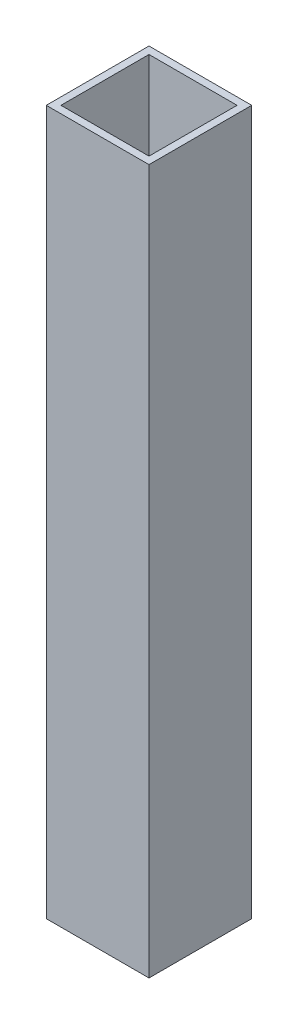
ISO-10303-21;
HEADER;
FILE_DESCRIPTION(('STEP AP214'),'2;1');
FILE_NAME('part.step','',(''),(''),'','','');
FILE_SCHEMA(('AUTOMOTIVE_DESIGN { 1 0 10303 214 1 1 1 1 }'));
ENDSEC;
DATA;
#1=APPLICATION_CONTEXT('core data for automotive mechanical design processes');
#2=APPLICATION_PROTOCOL_DEFINITION('international standard','automotive_design',2000,#1);
#3=PRODUCT_CONTEXT('',#1,'mechanical');
#4=PRODUCT('Part','Part','',(#3));
#5=PRODUCT_RELATED_PRODUCT_CATEGORY('part','',(#4));
#6=PRODUCT_DEFINITION_FORMATION('','',#4);
#7=PRODUCT_DEFINITION_CONTEXT('part definition',#1,'design');
#8=PRODUCT_DEFINITION('design','',#6,#7);
#9=PRODUCT_DEFINITION_SHAPE('','',#8);
#10=(LENGTH_UNIT() NAMED_UNIT(*) SI_UNIT(.MILLI.,.METRE.));
#11=(NAMED_UNIT(*) PLANE_ANGLE_UNIT() SI_UNIT($,.RADIAN.));
#12=(NAMED_UNIT(*) SI_UNIT($,.STERADIAN.) SOLID_ANGLE_UNIT());
#13=UNCERTAINTY_MEASURE_WITH_UNIT(LENGTH_MEASURE(1.E-05),#10,'distance_accuracy_value','');
#14=(GEOMETRIC_REPRESENTATION_CONTEXT(3) GLOBAL_UNCERTAINTY_ASSIGNED_CONTEXT((#13)) GLOBAL_UNIT_ASSIGNED_CONTEXT((#10,
#11,#12)) REPRESENTATION_CONTEXT('',''));
#15=CARTESIAN_POINT('',(0.,0.,0.));
#16=DIRECTION('',(0.,0.,1.));
#17=DIRECTION('',(1.,0.,0.));
#18=AXIS2_PLACEMENT_3D('',#15,#16,#17);
#19=CARTESIAN_POINT('',(22.225,-304.8,-323.900178003311));
#20=DIRECTION('',(0.,0.,1.));
#21=DIRECTION('',(1.,0.,0.));
#22=AXIS2_PLACEMENT_3D('',#19,#20,#21);
#23=PLANE('',#22);
#24=DIRECTION('',(1.,0.,0.));
#25=VECTOR('',#24,1.);
#26=CARTESIAN_POINT('',(22.225,0.,-323.900178003311));
#27=LINE('',#26,#25);
#28=CARTESIAN_POINT('',(0.,0.,-323.900178003311));
#29=VERTEX_POINT('',#28);
#30=CARTESIAN_POINT('',(44.45,0.,-323.900178003311));
#31=VERTEX_POINT('',#30);
#32=EDGE_CURVE('E175',#29,#31,#27,.T.);
#33=ORIENTED_EDGE('',*,*,#32,.F.);
#34=DIRECTION('',(0.,1.,0.));
#35=VECTOR('',#34,1.);
#36=CARTESIAN_POINT('',(0.,-304.8,-323.900178003311));
#37=LINE('',#36,#35);
#38=CARTESIAN_POINT('',(0.,-304.8,-323.900178003311));
#39=VERTEX_POINT('',#38);
#40=EDGE_CURVE('E11',#39,#29,#37,.T.);
#41=ORIENTED_EDGE('',*,*,#40,.F.);
#42=DIRECTION('',(1.,0.,0.));
#43=VECTOR('',#42,1.);
#44=CARTESIAN_POINT('',(22.225,-304.8,-323.900178003311));
#45=LINE('',#44,#43);
#46=CARTESIAN_POINT('',(44.45,-304.8,-323.900178003311));
#47=VERTEX_POINT('',#46);
#48=EDGE_CURVE('E127',#39,#47,#45,.T.);
#49=ORIENTED_EDGE('',*,*,#48,.T.);
#50=DIRECTION('',(0.,1.,0.));
#51=VECTOR('',#50,1.);
#52=CARTESIAN_POINT('',(44.45,-304.8,-323.900178003311));
#53=LINE('',#52,#51);
#54=EDGE_CURVE('E41',#47,#31,#53,.T.);
#55=ORIENTED_EDGE('',*,*,#54,.T.);
#56=EDGE_LOOP('',(#33,#41,#49,#55));
#57=FACE_BOUND('',#56,.T.);
#58=ADVANCED_FACE('F16',(#57),#23,.T.);
#59=CARTESIAN_POINT('',(0.,-304.8,-346.125178003311));
#60=DIRECTION('',(1.,0.,0.));
#61=DIRECTION('',(0.,0.,-1.));
#62=AXIS2_PLACEMENT_3D('',#59,#60,#61);
#63=PLANE('',#62);
#64=DIRECTION('',(0.,0.,-1.));
#65=VECTOR('',#64,1.);
#66=CARTESIAN_POINT('',(0.,0.,-346.125178003311));
#67=LINE('',#66,#65);
#68=CARTESIAN_POINT('',(0.,0.,-368.350178003311));
#69=VERTEX_POINT('',#68);
#70=EDGE_CURVE('E133',#29,#69,#67,.T.);
#71=ORIENTED_EDGE('',*,*,#70,.T.);
#72=DIRECTION('',(0.,1.,0.));
#73=VECTOR('',#72,1.);
#74=CARTESIAN_POINT('',(0.,-304.8,-368.350178003311));
#75=LINE('',#74,#73);
#76=CARTESIAN_POINT('',(0.,-304.8,-368.350178003311));
#77=VERTEX_POINT('',#76);
#78=EDGE_CURVE('E27',#77,#69,#75,.T.);
#79=ORIENTED_EDGE('',*,*,#78,.F.);
#80=DIRECTION('',(0.,0.,-1.));
#81=VECTOR('',#80,1.);
#82=CARTESIAN_POINT('',(0.,-304.8,-346.125178003311));
#83=LINE('',#82,#81);
#84=EDGE_CURVE('E122',#39,#77,#83,.T.);
#85=ORIENTED_EDGE('',*,*,#84,.F.);
#86=ORIENTED_EDGE('',*,*,#40,.T.);
#87=EDGE_LOOP('',(#71,#79,#85,#86));
#88=FACE_BOUND('',#87,.T.);
#89=ADVANCED_FACE('F131',(#88),#63,.F.);
#90=CARTESIAN_POINT('',(22.225,-304.8,-368.350178003311));
#91=DIRECTION('',(0.,0.,1.));
#92=DIRECTION('',(1.,0.,0.));
#93=AXIS2_PLACEMENT_3D('',#90,#91,#92);
#94=PLANE('',#93);
#95=DIRECTION('',(1.,0.,0.));
#96=VECTOR('',#95,1.);
#97=CARTESIAN_POINT('',(22.225,0.,-368.350178003311));
#98=LINE('',#97,#96);
#99=CARTESIAN_POINT('',(44.45,0.,-368.350178003311));
#100=VERTEX_POINT('',#99);
#101=EDGE_CURVE('E170',#69,#100,#98,.T.);
#102=ORIENTED_EDGE('',*,*,#101,.T.);
#103=DIRECTION('',(0.,1.,0.));
#104=VECTOR('',#103,1.);
#105=CARTESIAN_POINT('',(44.45,-304.8,-368.350178003311));
#106=LINE('',#105,#104);
#107=CARTESIAN_POINT('',(44.45,-304.8,-368.350178003311));
#108=VERTEX_POINT('',#107);
#109=EDGE_CURVE('E79',#108,#100,#106,.T.);
#110=ORIENTED_EDGE('',*,*,#109,.F.);
#111=DIRECTION('',(1.,0.,0.));
#112=VECTOR('',#111,1.);
#113=CARTESIAN_POINT('',(22.225,-304.8,-368.350178003311));
#114=LINE('',#113,#112);
#115=EDGE_CURVE('E113',#77,#108,#114,.T.);
#116=ORIENTED_EDGE('',*,*,#115,.F.);
#117=ORIENTED_EDGE('',*,*,#78,.T.);
#118=EDGE_LOOP('',(#102,#110,#116,#117));
#119=FACE_BOUND('',#118,.T.);
#120=ADVANCED_FACE('F115',(#119),#94,.F.);
#121=CARTESIAN_POINT('',(3.175,-304.8,-346.125178003311));
#122=DIRECTION('',(1.,0.,0.));
#123=DIRECTION('',(0.,0.,-1.));
#124=AXIS2_PLACEMENT_3D('',#121,#122,#123);
#125=PLANE('',#124);
#126=DIRECTION('',(0.,0.,-1.));
#127=VECTOR('',#126,1.);
#128=CARTESIAN_POINT('',(3.175,0.,-346.125178003311));
#129=LINE('',#128,#127);
#130=CARTESIAN_POINT('',(3.175,0.,-327.075178003311));
#131=VERTEX_POINT('',#130);
#132=CARTESIAN_POINT('',(3.175,0.,-365.175178003311));
#133=VERTEX_POINT('',#132);
#134=EDGE_CURVE('E187',#131,#133,#129,.T.);
#135=ORIENTED_EDGE('',*,*,#134,.F.);
#136=DIRECTION('',(0.,1.,0.));
#137=VECTOR('',#136,1.);
#138=CARTESIAN_POINT('',(3.175,-304.8,-327.075178003311));
#139=LINE('',#138,#137);
#140=CARTESIAN_POINT('',(3.175,-304.8,-327.075178003311));
#141=VERTEX_POINT('',#140);
#142=EDGE_CURVE('E20',#141,#131,#139,.T.);
#143=ORIENTED_EDGE('',*,*,#142,.F.);
#144=DIRECTION('',(0.,0.,-1.));
#145=VECTOR('',#144,1.);
#146=CARTESIAN_POINT('',(3.175,-304.8,-346.125178003311));
#147=LINE('',#146,#145);
#148=CARTESIAN_POINT('',(3.175,-304.8,-365.175178003311));
#149=VERTEX_POINT('',#148);
#150=EDGE_CURVE('E169',#141,#149,#147,.T.);
#151=ORIENTED_EDGE('',*,*,#150,.T.);
#152=DIRECTION('',(0.,1.,0.));
#153=VECTOR('',#152,1.);
#154=CARTESIAN_POINT('',(3.175,-304.8,-365.175178003311));
#155=LINE('',#154,#153);
#156=EDGE_CURVE('E144',#149,#133,#155,.T.);
#157=ORIENTED_EDGE('',*,*,#156,.T.);
#158=EDGE_LOOP('',(#135,#143,#151,#157));
#159=FACE_BOUND('',#158,.T.);
#160=ADVANCED_FACE('F18',(#159),#125,.T.);
#161=CARTESIAN_POINT('',(22.225,-304.8,-327.075178003311));
#162=DIRECTION('',(0.,0.,1.));
#163=DIRECTION('',(1.,0.,0.));
#164=AXIS2_PLACEMENT_3D('',#161,#162,#163);
#165=PLANE('',#164);
#166=DIRECTION('',(1.,0.,0.));
#167=VECTOR('',#166,1.);
#168=CARTESIAN_POINT('',(22.225,0.,-327.075178003311));
#169=LINE('',#168,#167);
#170=CARTESIAN_POINT('',(41.275,0.,-327.075178003311));
#171=VERTEX_POINT('',#170);
#172=EDGE_CURVE('E184',#131,#171,#169,.T.);
#173=ORIENTED_EDGE('',*,*,#172,.T.);
#174=DIRECTION('',(0.,1.,0.));
#175=VECTOR('',#174,1.);
#176=CARTESIAN_POINT('',(41.275,-304.8,-327.075178003311));
#177=LINE('',#176,#175);
#178=CARTESIAN_POINT('',(41.275,-304.8,-327.075178003311));
#179=VERTEX_POINT('',#178);
#180=EDGE_CURVE('E148',#179,#171,#177,.T.);
#181=ORIENTED_EDGE('',*,*,#180,.F.);
#182=DIRECTION('',(1.,0.,0.));
#183=VECTOR('',#182,1.);
#184=CARTESIAN_POINT('',(22.225,-304.8,-327.075178003311));
#185=LINE('',#184,#183);
#186=EDGE_CURVE('E202',#141,#179,#185,.T.);
#187=ORIENTED_EDGE('',*,*,#186,.F.);
#188=ORIENTED_EDGE('',*,*,#142,.T.);
#189=EDGE_LOOP('',(#173,#181,#187,#188));
#190=FACE_BOUND('',#189,.T.);
#191=ADVANCED_FACE('F216',(#190),#165,.F.);
#192=CARTESIAN_POINT('',(41.275,-304.8,-346.125178003311));
#193=DIRECTION('',(1.,0.,0.));
#194=DIRECTION('',(0.,0.,-1.));
#195=AXIS2_PLACEMENT_3D('',#192,#193,#194);
#196=PLANE('',#195);
#197=DIRECTION('',(0.,0.,-1.));
#198=VECTOR('',#197,1.);
#199=CARTESIAN_POINT('',(41.275,0.,-346.125178003311));
#200=LINE('',#199,#198);
#201=CARTESIAN_POINT('',(41.275,0.,-365.175178003311));
#202=VERTEX_POINT('',#201);
#203=EDGE_CURVE('E181',#171,#202,#200,.T.);
#204=ORIENTED_EDGE('',*,*,#203,.T.);
#205=DIRECTION('',(0.,1.,0.));
#206=VECTOR('',#205,1.);
#207=CARTESIAN_POINT('',(41.275,-304.8,-365.175178003311));
#208=LINE('',#207,#206);
#209=CARTESIAN_POINT('',(41.275,-304.8,-365.175178003311));
#210=VERTEX_POINT('',#209);
#211=EDGE_CURVE('E147',#210,#202,#208,.T.);
#212=ORIENTED_EDGE('',*,*,#211,.F.);
#213=DIRECTION('',(0.,0.,-1.));
#214=VECTOR('',#213,1.);
#215=CARTESIAN_POINT('',(41.275,-304.8,-346.125178003311));
#216=LINE('',#215,#214);
#217=EDGE_CURVE('E199',#179,#210,#216,.T.);
#218=ORIENTED_EDGE('',*,*,#217,.F.);
#219=ORIENTED_EDGE('',*,*,#180,.T.);
#220=EDGE_LOOP('',(#204,#212,#218,#219));
#221=FACE_BOUND('',#220,.T.);
#222=ADVANCED_FACE('F217',(#221),#196,.F.);
#223=CARTESIAN_POINT('',(22.225,-304.8,-365.175178003311));
#224=DIRECTION('',(0.,0.,1.));
#225=DIRECTION('',(1.,0.,0.));
#226=AXIS2_PLACEMENT_3D('',#223,#224,#225);
#227=PLANE('',#226);
#228=DIRECTION('',(1.,0.,0.));
#229=VECTOR('',#228,1.);
#230=CARTESIAN_POINT('',(22.225,0.,-365.175178003311));
#231=LINE('',#230,#229);
#232=EDGE_CURVE('E178',#133,#202,#231,.T.);
#233=ORIENTED_EDGE('',*,*,#232,.F.);
#234=ORIENTED_EDGE('',*,*,#156,.F.);
#235=DIRECTION('',(1.,0.,0.));
#236=VECTOR('',#235,1.);
#237=CARTESIAN_POINT('',(22.225,-304.8,-365.175178003311));
#238=LINE('',#237,#236);
#239=EDGE_CURVE('E195',#149,#210,#238,.T.);
#240=ORIENTED_EDGE('',*,*,#239,.T.);
#241=ORIENTED_EDGE('',*,*,#211,.T.);
#242=EDGE_LOOP('',(#233,#234,#240,#241));
#243=FACE_BOUND('',#242,.T.);
#244=ADVANCED_FACE('F212',(#243),#227,.T.);
#245=CARTESIAN_POINT('',(44.45,-304.8,-346.125178003311));
#246=DIRECTION('',(1.,0.,0.));
#247=DIRECTION('',(0.,0.,-1.));
#248=AXIS2_PLACEMENT_3D('',#245,#246,#247);
#249=PLANE('',#248);
#250=DIRECTION('',(0.,0.,-1.));
#251=VECTOR('',#250,1.);
#252=CARTESIAN_POINT('',(44.45,0.,-346.125178003311));
#253=LINE('',#252,#251);
#254=EDGE_CURVE('E165',#31,#100,#253,.T.);
#255=ORIENTED_EDGE('',*,*,#254,.F.);
#256=ORIENTED_EDGE('',*,*,#54,.F.);
#257=DIRECTION('',(0.,0.,-1.));
#258=VECTOR('',#257,1.);
#259=CARTESIAN_POINT('',(44.45,-304.8,-346.125178003311));
#260=LINE('',#259,#258);
#261=EDGE_CURVE('E121',#47,#108,#260,.T.);
#262=ORIENTED_EDGE('',*,*,#261,.T.);
#263=ORIENTED_EDGE('',*,*,#109,.T.);
#264=EDGE_LOOP('',(#255,#256,#262,#263));
#265=FACE_BOUND('',#264,.T.);
#266=ADVANCED_FACE('F225',(#265),#249,.T.);
#267=CARTESIAN_POINT('',(22.225,-304.8,-346.125178003311));
#268=DIRECTION('',(0.,-1.,0.));
#269=DIRECTION('',(1.,0.,0.));
#270=AXIS2_PLACEMENT_3D('',#267,#268,#269);
#271=PLANE('',#270);
#272=ORIENTED_EDGE('',*,*,#150,.F.);
#273=ORIENTED_EDGE('',*,*,#186,.T.);
#274=ORIENTED_EDGE('',*,*,#217,.T.);
#275=ORIENTED_EDGE('',*,*,#239,.F.);
#276=EDGE_LOOP('',(#272,#273,#274,#275));
#277=FACE_BOUND('',#276,.T.);
#278=ORIENTED_EDGE('',*,*,#48,.F.);
#279=ORIENTED_EDGE('',*,*,#84,.T.);
#280=ORIENTED_EDGE('',*,*,#115,.T.);
#281=ORIENTED_EDGE('',*,*,#261,.F.);
#282=EDGE_LOOP('',(#278,#279,#280,#281));
#283=FACE_BOUND('',#282,.T.);
#284=ADVANCED_FACE('F126',(#277,#283),#271,.T.);
#285=CARTESIAN_POINT('',(22.225,0.,-346.125178003311));
#286=DIRECTION('',(0.,-1.,0.));
#287=DIRECTION('',(1.,0.,0.));
#288=AXIS2_PLACEMENT_3D('',#285,#286,#287);
#289=PLANE('',#288);
#290=ORIENTED_EDGE('',*,*,#134,.T.);
#291=ORIENTED_EDGE('',*,*,#232,.T.);
#292=ORIENTED_EDGE('',*,*,#203,.F.);
#293=ORIENTED_EDGE('',*,*,#172,.F.);
#294=EDGE_LOOP('',(#290,#291,#292,#293));
#295=FACE_BOUND('',#294,.T.);
#296=ORIENTED_EDGE('',*,*,#32,.T.);
#297=ORIENTED_EDGE('',*,*,#254,.T.);
#298=ORIENTED_EDGE('',*,*,#101,.F.);
#299=ORIENTED_EDGE('',*,*,#70,.F.);
#300=EDGE_LOOP('',(#296,#297,#298,#299));
#301=FACE_BOUND('',#300,.T.);
#302=ADVANCED_FACE('F214',(#295,#301),#289,.F.);
#303=CLOSED_SHELL('',(#58,#89,#120,#160,#191,#222,#244,#266,#284,#302));
#304=MANIFOLD_SOLID_BREP('B1',#303);
#305=ADVANCED_BREP_SHAPE_REPRESENTATION('',(#18,#304),#14);
#306=SHAPE_DEFINITION_REPRESENTATION(#9,#305);
ENDSEC;
END-ISO-10303-21;
